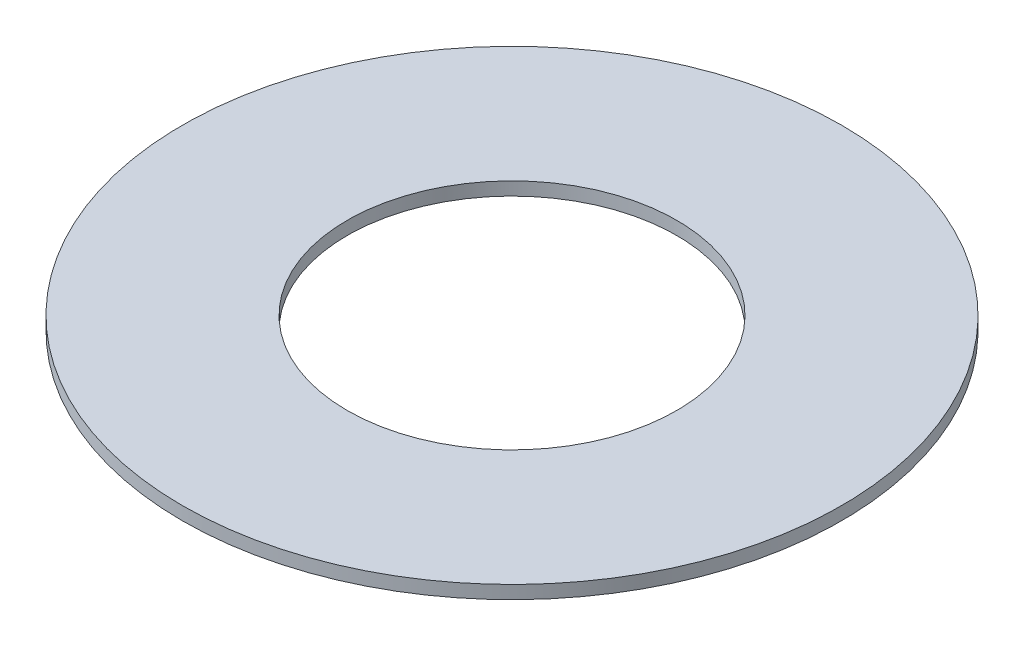
ISO-10303-21;
HEADER;
FILE_DESCRIPTION(('STEP AP214'),'2;1');
FILE_NAME('part.step','',(''),(''),'','','');
FILE_SCHEMA(('AUTOMOTIVE_DESIGN { 1 0 10303 214 1 1 1 1 }'));
ENDSEC;
DATA;
#1=APPLICATION_CONTEXT('core data for automotive mechanical design processes');
#2=APPLICATION_PROTOCOL_DEFINITION('international standard','automotive_design',2000,#1);
#3=PRODUCT_CONTEXT('',#1,'mechanical');
#4=PRODUCT('Part','Part','',(#3));
#5=PRODUCT_RELATED_PRODUCT_CATEGORY('part','',(#4));
#6=PRODUCT_DEFINITION_FORMATION('','',#4);
#7=PRODUCT_DEFINITION_CONTEXT('part definition',#1,'design');
#8=PRODUCT_DEFINITION('design','',#6,#7);
#9=PRODUCT_DEFINITION_SHAPE('','',#8);
#10=(LENGTH_UNIT() NAMED_UNIT(*) SI_UNIT(.MILLI.,.METRE.));
#11=(NAMED_UNIT(*) PLANE_ANGLE_UNIT() SI_UNIT($,.RADIAN.));
#12=(NAMED_UNIT(*) SI_UNIT($,.STERADIAN.) SOLID_ANGLE_UNIT());
#13=UNCERTAINTY_MEASURE_WITH_UNIT(LENGTH_MEASURE(1.E-05),#10,'distance_accuracy_value','');
#14=(GEOMETRIC_REPRESENTATION_CONTEXT(3) GLOBAL_UNCERTAINTY_ASSIGNED_CONTEXT((#13)) GLOBAL_UNIT_ASSIGNED_CONTEXT((#10,
#11,#12)) REPRESENTATION_CONTEXT('',''));
#15=CARTESIAN_POINT('',(0.,0.,0.));
#16=DIRECTION('',(0.,0.,1.));
#17=DIRECTION('',(1.,0.,0.));
#18=AXIS2_PLACEMENT_3D('',#15,#16,#17);
#19=CARTESIAN_POINT('',(0.,0.2,0.));
#20=DIRECTION('',(0.,1.,0.));
#21=DIRECTION('',(0.,0.,1.));
#22=AXIS2_PLACEMENT_3D('',#19,#20,#21);
#23=PLANE('',#22);
#24=CARTESIAN_POINT('',(0.,0.2,0.));
#25=DIRECTION('',(0.,1.,0.));
#26=DIRECTION('',(0.,0.,1.));
#27=AXIS2_PLACEMENT_3D('',#24,#25,#26);
#28=CIRCLE('',#27,5.);
#29=CARTESIAN_POINT('',(0.,0.2,5.));
#30=VERTEX_POINT('',#29);
#31=EDGE_CURVE('E10',#30,#30,#28,.T.);
#32=ORIENTED_EDGE('',*,*,#31,.T.);
#33=EDGE_LOOP('',(#32));
#34=FACE_BOUND('',#33,.T.);
#35=CARTESIAN_POINT('',(0.,0.2,0.));
#36=DIRECTION('',(0.,1.,0.));
#37=DIRECTION('',(0.,0.,1.));
#38=AXIS2_PLACEMENT_3D('',#35,#36,#37);
#39=CIRCLE('',#38,2.5);
#40=CARTESIAN_POINT('',(0.,0.2,2.5));
#41=VERTEX_POINT('',#40);
#42=EDGE_CURVE('E42',#41,#41,#39,.T.);
#43=ORIENTED_EDGE('',*,*,#42,.F.);
#44=EDGE_LOOP('',(#43));
#45=FACE_BOUND('',#44,.T.);
#46=ADVANCED_FACE('F31',(#34,#45),#23,.T.);
#47=CARTESIAN_POINT('',(0.,0.,0.));
#48=DIRECTION('',(0.,1.,0.));
#49=DIRECTION('',(0.,0.,1.));
#50=AXIS2_PLACEMENT_3D('',#47,#48,#49);
#51=PLANE('',#50);
#52=CARTESIAN_POINT('',(0.,0.,0.));
#53=DIRECTION('',(0.,1.,0.));
#54=DIRECTION('',(0.,0.,1.));
#55=AXIS2_PLACEMENT_3D('',#52,#53,#54);
#56=CIRCLE('',#55,5.);
#57=CARTESIAN_POINT('',(0.,0.,5.));
#58=VERTEX_POINT('',#57);
#59=EDGE_CURVE('E35',#58,#58,#56,.T.);
#60=ORIENTED_EDGE('',*,*,#59,.F.);
#61=EDGE_LOOP('',(#60));
#62=FACE_BOUND('',#61,.T.);
#63=CARTESIAN_POINT('',(0.,0.,0.));
#64=DIRECTION('',(0.,1.,0.));
#65=DIRECTION('',(0.,0.,1.));
#66=AXIS2_PLACEMENT_3D('',#63,#64,#65);
#67=CIRCLE('',#66,2.5);
#68=CARTESIAN_POINT('',(0.,0.,2.5));
#69=VERTEX_POINT('',#68);
#70=EDGE_CURVE('E44',#69,#69,#67,.T.);
#71=ORIENTED_EDGE('',*,*,#70,.T.);
#72=EDGE_LOOP('',(#71));
#73=FACE_BOUND('',#72,.T.);
#74=ADVANCED_FACE('F54',(#62,#73),#51,.F.);
#75=CARTESIAN_POINT('',(0.,0.2,0.));
#76=DIRECTION('',(0.,-1.,0.));
#77=DIRECTION('',(0.,0.,-1.));
#78=AXIS2_PLACEMENT_3D('',#75,#76,#77);
#79=CYLINDRICAL_SURFACE('',#78,5.);
#80=ORIENTED_EDGE('',*,*,#31,.F.);
#81=EDGE_LOOP('',(#80));
#82=FACE_BOUND('',#81,.T.);
#83=ORIENTED_EDGE('',*,*,#59,.T.);
#84=EDGE_LOOP('',(#83));
#85=FACE_BOUND('',#84,.T.);
#86=ADVANCED_FACE('F33',(#82,#85),#79,.T.);
#87=CARTESIAN_POINT('',(0.,0.2,0.));
#88=DIRECTION('',(0.,-1.,0.));
#89=DIRECTION('',(0.,0.,-1.));
#90=AXIS2_PLACEMENT_3D('',#87,#88,#89);
#91=CYLINDRICAL_SURFACE('',#90,2.5);
#92=ORIENTED_EDGE('',*,*,#42,.T.);
#93=EDGE_LOOP('',(#92));
#94=FACE_BOUND('',#93,.T.);
#95=ORIENTED_EDGE('',*,*,#70,.F.);
#96=EDGE_LOOP('',(#95));
#97=FACE_BOUND('',#96,.T.);
#98=ADVANCED_FACE('F50',(#94,#97),#91,.F.);
#99=CLOSED_SHELL('',(#46,#74,#86,#98));
#100=MANIFOLD_SOLID_BREP('B2',#99);
#101=ADVANCED_BREP_SHAPE_REPRESENTATION('',(#18,#100),#14);
#102=SHAPE_DEFINITION_REPRESENTATION(#9,#101);
ENDSEC;
END-ISO-10303-21;
